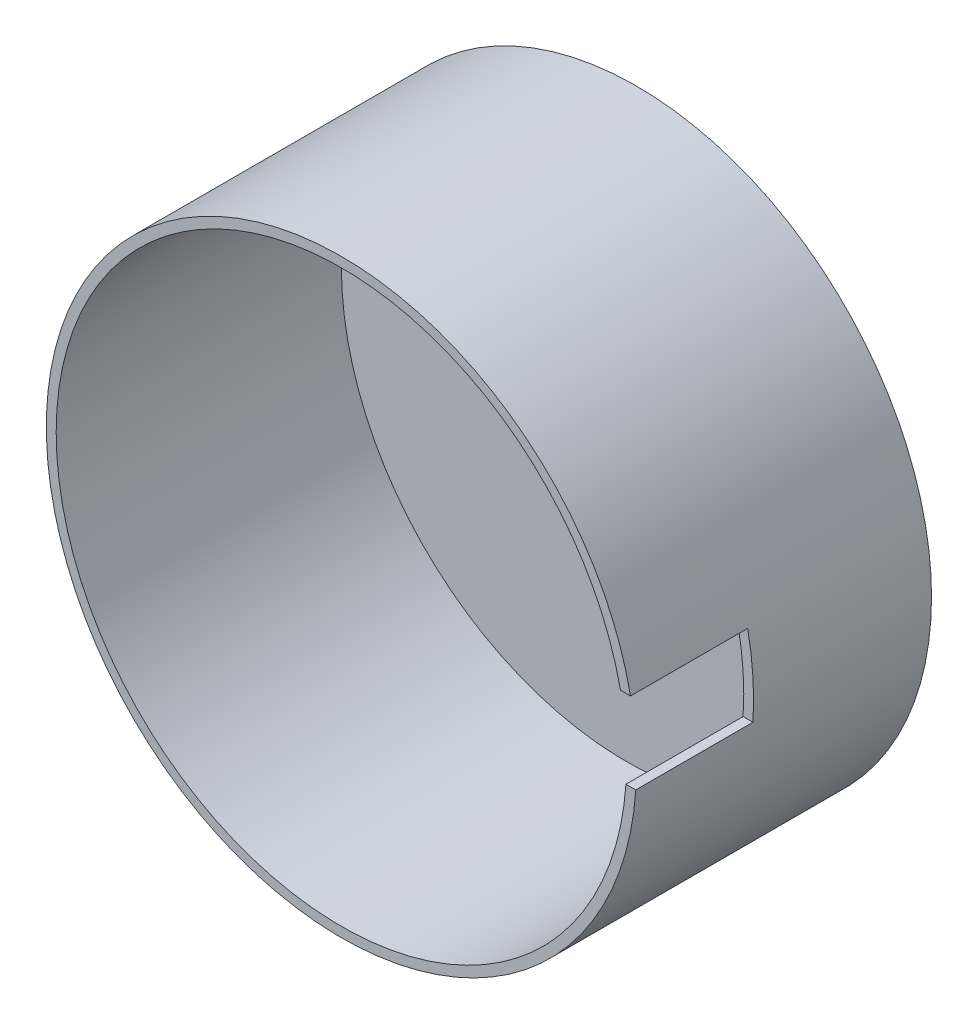
ISO-10303-21;
HEADER;
FILE_DESCRIPTION(('STEP AP214'),'2;1');
FILE_NAME('part.step','',(''),(''),'','','');
FILE_SCHEMA(('AUTOMOTIVE_DESIGN { 1 0 10303 214 1 1 1 1 }'));
ENDSEC;
DATA;
#1=APPLICATION_CONTEXT('core data for automotive mechanical design processes');
#2=APPLICATION_PROTOCOL_DEFINITION('international standard','automotive_design',2000,#1);
#3=PRODUCT_CONTEXT('',#1,'mechanical');
#4=PRODUCT('Part','Part','',(#3));
#5=PRODUCT_RELATED_PRODUCT_CATEGORY('part','',(#4));
#6=PRODUCT_DEFINITION_FORMATION('','',#4);
#7=PRODUCT_DEFINITION_CONTEXT('part definition',#1,'design');
#8=PRODUCT_DEFINITION('design','',#6,#7);
#9=PRODUCT_DEFINITION_SHAPE('','',#8);
#10=(LENGTH_UNIT() NAMED_UNIT(*) SI_UNIT(.MILLI.,.METRE.));
#11=(NAMED_UNIT(*) PLANE_ANGLE_UNIT() SI_UNIT($,.RADIAN.));
#12=(NAMED_UNIT(*) SI_UNIT($,.STERADIAN.) SOLID_ANGLE_UNIT());
#13=UNCERTAINTY_MEASURE_WITH_UNIT(LENGTH_MEASURE(1.E-05),#10,'distance_accuracy_value','');
#14=(GEOMETRIC_REPRESENTATION_CONTEXT(3) GLOBAL_UNCERTAINTY_ASSIGNED_CONTEXT((#13)) GLOBAL_UNIT_ASSIGNED_CONTEXT((#10,
#11,#12)) REPRESENTATION_CONTEXT('',''));
#15=CARTESIAN_POINT('',(0.,0.,0.));
#16=DIRECTION('',(0.,0.,1.));
#17=DIRECTION('',(1.,0.,0.));
#18=AXIS2_PLACEMENT_3D('',#15,#16,#17);
#19=CARTESIAN_POINT('',(0.,0.,150.));
#20=DIRECTION('',(0.,0.,-1.));
#21=DIRECTION('',(-1.,0.,0.));
#22=AXIS2_PLACEMENT_3D('',#19,#20,#21);
#23=CYLINDRICAL_SURFACE('',#22,150.);
#24=CARTESIAN_POINT('',(0.,0.,0.));
#25=DIRECTION('',(0.,0.,1.));
#26=DIRECTION('',(1.,0.,0.));
#27=AXIS2_PLACEMENT_3D('',#24,#25,#26);
#28=CIRCLE('',#27,150.);
#29=CARTESIAN_POINT('',(150.,0.,0.));
#30=VERTEX_POINT('',#29);
#31=EDGE_CURVE('E106',#30,#30,#28,.T.);
#32=ORIENTED_EDGE('',*,*,#31,.T.);
#33=EDGE_LOOP('',(#32));
#34=FACE_BOUND('',#33,.T.);
#35=CARTESIAN_POINT('',(0.,0.,90.445229028187));
#36=DIRECTION('',(0.,0.,1.));
#37=DIRECTION('',(1.,0.,0.));
#38=AXIS2_PLACEMENT_3D('',#35,#36,#37);
#39=CIRCLE('',#38,150.);
#40=CARTESIAN_POINT('',(149.662317229563,-10.0593638704249,90.445229028187));
#41=VERTEX_POINT('',#40);
#42=CARTESIAN_POINT('',(146.981489678654,29.9406361295751,90.445229028187));
#43=VERTEX_POINT('',#42);
#44=EDGE_CURVE('E78',#41,#43,#39,.T.);
#45=ORIENTED_EDGE('',*,*,#44,.F.);
#46=DIRECTION('',(0.,0.,-1.));
#47=VECTOR('',#46,1.);
#48=CARTESIAN_POINT('',(149.662317229563,-10.0593638704249,150.));
#49=LINE('',#48,#47);
#50=CARTESIAN_POINT('',(149.662317229563,-10.0593638704249,150.));
#51=VERTEX_POINT('',#50);
#52=EDGE_CURVE('E80',#51,#41,#49,.T.);
#53=ORIENTED_EDGE('',*,*,#52,.F.);
#54=CARTESIAN_POINT('',(0.,0.,150.));
#55=DIRECTION('',(0.,0.,1.));
#56=DIRECTION('',(1.,0.,0.));
#57=AXIS2_PLACEMENT_3D('',#54,#55,#56);
#58=CIRCLE('',#57,150.);
#59=CARTESIAN_POINT('',(146.981489678654,29.9406361295751,150.));
#60=VERTEX_POINT('',#59);
#61=EDGE_CURVE('E107',#60,#51,#58,.T.);
#62=ORIENTED_EDGE('',*,*,#61,.F.);
#63=DIRECTION('',(0.,0.,-1.));
#64=VECTOR('',#63,1.);
#65=CARTESIAN_POINT('',(146.981489678654,29.9406361295751,150.));
#66=LINE('',#65,#64);
#67=EDGE_CURVE('E59',#43,#60,#66,.F.);
#68=ORIENTED_EDGE('',*,*,#67,.F.);
#69=EDGE_LOOP('',(#45,#53,#62,#68));
#70=FACE_BOUND('',#69,.T.);
#71=ADVANCED_FACE('F37',(#34,#70),#23,.T.);
#72=CARTESIAN_POINT('',(0.,0.,150.));
#73=DIRECTION('',(0.,0.,1.));
#74=DIRECTION('',(1.,0.,0.));
#75=AXIS2_PLACEMENT_3D('',#72,#73,#74);
#76=PLANE('',#75);
#77=CARTESIAN_POINT('',(0.,0.,150.));
#78=DIRECTION('',(0.,0.,1.));
#79=DIRECTION('',(1.,0.,0.));
#80=AXIS2_PLACEMENT_3D('',#77,#78,#79);
#81=CIRCLE('',#80,145.);
#82=CARTESIAN_POINT('',(141.875150425141,29.9406361295751,150.));
#83=VERTEX_POINT('',#82);
#84=CARTESIAN_POINT('',(144.6506453443,-10.0593638704249,150.));
#85=VERTEX_POINT('',#84);
#86=EDGE_CURVE('E103',#83,#85,#81,.T.);
#87=ORIENTED_EDGE('',*,*,#86,.F.);
#88=DIRECTION('',(1.,0.,0.));
#89=VECTOR('',#88,1.);
#90=CARTESIAN_POINT('',(0.,29.9406361295751,150.));
#91=LINE('',#90,#89);
#92=EDGE_CURVE('E89',#83,#60,#91,.T.);
#93=ORIENTED_EDGE('',*,*,#92,.T.);
#94=ORIENTED_EDGE('',*,*,#61,.T.);
#95=DIRECTION('',(-1.,0.,0.));
#96=VECTOR('',#95,1.);
#97=CARTESIAN_POINT('',(0.,-10.0593638704249,150.));
#98=LINE('',#97,#96);
#99=EDGE_CURVE('E88',#51,#85,#98,.T.);
#100=ORIENTED_EDGE('',*,*,#99,.T.);
#101=EDGE_LOOP('',(#87,#93,#94,#100));
#102=FACE_BOUND('',#101,.T.);
#103=ADVANCED_FACE('F116',(#102),#76,.T.);
#104=CARTESIAN_POINT('',(0.,0.,150.));
#105=DIRECTION('',(0.,0.,-1.));
#106=DIRECTION('',(-1.,0.,0.));
#107=AXIS2_PLACEMENT_3D('',#104,#105,#106);
#108=CYLINDRICAL_SURFACE('',#107,145.);
#109=CARTESIAN_POINT('',(0.,0.,5.));
#110=DIRECTION('',(0.,0.,1.));
#111=DIRECTION('',(1.,0.,0.));
#112=AXIS2_PLACEMENT_3D('',#109,#110,#111);
#113=CIRCLE('',#112,145.);
#114=CARTESIAN_POINT('',(145.,0.,5.));
#115=VERTEX_POINT('',#114);
#116=EDGE_CURVE('E84',#115,#115,#113,.T.);
#117=ORIENTED_EDGE('',*,*,#116,.F.);
#118=EDGE_LOOP('',(#117));
#119=FACE_BOUND('',#118,.T.);
#120=CARTESIAN_POINT('',(0.,0.,90.445229028187));
#121=DIRECTION('',(0.,0.,1.));
#122=DIRECTION('',(1.,0.,0.));
#123=AXIS2_PLACEMENT_3D('',#120,#121,#122);
#124=CIRCLE('',#123,145.);
#125=CARTESIAN_POINT('',(144.6506453443,-10.0593638704249,90.445229028187));
#126=VERTEX_POINT('',#125);
#127=CARTESIAN_POINT('',(141.875150425141,29.9406361295751,90.445229028187));
#128=VERTEX_POINT('',#127);
#129=EDGE_CURVE('E44',#126,#128,#124,.T.);
#130=ORIENTED_EDGE('',*,*,#129,.T.);
#131=DIRECTION('',(0.,0.,-1.));
#132=VECTOR('',#131,1.);
#133=CARTESIAN_POINT('',(141.875150425141,29.9406361295751,150.));
#134=LINE('',#133,#132);
#135=EDGE_CURVE('E11',#128,#83,#134,.F.);
#136=ORIENTED_EDGE('',*,*,#135,.T.);
#137=ORIENTED_EDGE('',*,*,#86,.T.);
#138=DIRECTION('',(0.,0.,-1.));
#139=VECTOR('',#138,1.);
#140=CARTESIAN_POINT('',(144.6506453443,-10.0593638704249,150.));
#141=LINE('',#140,#139);
#142=EDGE_CURVE('E109',#85,#126,#141,.T.);
#143=ORIENTED_EDGE('',*,*,#142,.T.);
#144=EDGE_LOOP('',(#130,#136,#137,#143));
#145=FACE_BOUND('',#144,.T.);
#146=ADVANCED_FACE('F113',(#119,#145),#108,.F.);
#147=CARTESIAN_POINT('',(0.,0.,0.));
#148=DIRECTION('',(0.,0.,1.));
#149=DIRECTION('',(1.,0.,0.));
#150=AXIS2_PLACEMENT_3D('',#147,#148,#149);
#151=PLANE('',#150);
#152=ORIENTED_EDGE('',*,*,#31,.F.);
#153=EDGE_LOOP('',(#152));
#154=FACE_BOUND('',#153,.T.);
#155=ADVANCED_FACE('F135',(#154),#151,.F.);
#156=CARTESIAN_POINT('',(0.,0.,5.));
#157=DIRECTION('',(0.,0.,1.));
#158=DIRECTION('',(1.,0.,0.));
#159=AXIS2_PLACEMENT_3D('',#156,#157,#158);
#160=PLANE('',#159);
#161=ORIENTED_EDGE('',*,*,#116,.T.);
#162=EDGE_LOOP('',(#161));
#163=FACE_BOUND('',#162,.T.);
#164=ADVANCED_FACE('F125',(#163),#160,.T.);
#165=CARTESIAN_POINT('',(150.,29.9406361295751,90.445229028187));
#166=DIRECTION('',(0.,0.,1.));
#167=DIRECTION('',(1.,0.,0.));
#168=AXIS2_PLACEMENT_3D('',#165,#166,#167);
#169=PLANE('',#168);
#170=ORIENTED_EDGE('',*,*,#44,.T.);
#171=DIRECTION('',(-1.,0.,0.));
#172=VECTOR('',#171,1.);
#173=CARTESIAN_POINT('',(150.,29.9406361295751,90.445229028187));
#174=LINE('',#173,#172);
#175=EDGE_CURVE('E94',#43,#128,#174,.T.);
#176=ORIENTED_EDGE('',*,*,#175,.T.);
#177=ORIENTED_EDGE('',*,*,#129,.F.);
#178=DIRECTION('',(-1.,0.,0.));
#179=VECTOR('',#178,1.);
#180=CARTESIAN_POINT('',(150.,-10.0593638704249,90.445229028187));
#181=LINE('',#180,#179);
#182=EDGE_CURVE('E51',#41,#126,#181,.T.);
#183=ORIENTED_EDGE('',*,*,#182,.F.);
#184=EDGE_LOOP('',(#170,#176,#177,#183));
#185=FACE_BOUND('',#184,.T.);
#186=ADVANCED_FACE('F91',(#185),#169,.T.);
#187=CARTESIAN_POINT('',(150.,29.9406361295751,150.445229028187));
#188=DIRECTION('',(0.,-1.,0.));
#189=DIRECTION('',(0.,0.,-1.));
#190=AXIS2_PLACEMENT_3D('',#187,#188,#189);
#191=PLANE('',#190);
#192=ORIENTED_EDGE('',*,*,#67,.T.);
#193=ORIENTED_EDGE('',*,*,#92,.F.);
#194=ORIENTED_EDGE('',*,*,#135,.F.);
#195=ORIENTED_EDGE('',*,*,#175,.F.);
#196=EDGE_LOOP('',(#192,#193,#194,#195));
#197=FACE_BOUND('',#196,.T.);
#198=ADVANCED_FACE('F117',(#197),#191,.T.);
#199=CARTESIAN_POINT('',(150.,-10.0593638704249,150.445229028187));
#200=DIRECTION('',(0.,1.,0.));
#201=DIRECTION('',(0.,0.,1.));
#202=AXIS2_PLACEMENT_3D('',#199,#200,#201);
#203=PLANE('',#202);
#204=ORIENTED_EDGE('',*,*,#52,.T.);
#205=ORIENTED_EDGE('',*,*,#182,.T.);
#206=ORIENTED_EDGE('',*,*,#142,.F.);
#207=ORIENTED_EDGE('',*,*,#99,.F.);
#208=EDGE_LOOP('',(#204,#205,#206,#207));
#209=FACE_BOUND('',#208,.T.);
#210=ADVANCED_FACE('F86',(#209),#203,.T.);
#211=CLOSED_SHELL('',(#71,#103,#146,#155,#164,#186,#198,#210));
#212=MANIFOLD_SOLID_BREP('B2',#211);
#213=ADVANCED_BREP_SHAPE_REPRESENTATION('',(#18,#212),#14);
#214=SHAPE_DEFINITION_REPRESENTATION(#9,#213);
ENDSEC;
END-ISO-10303-21;
